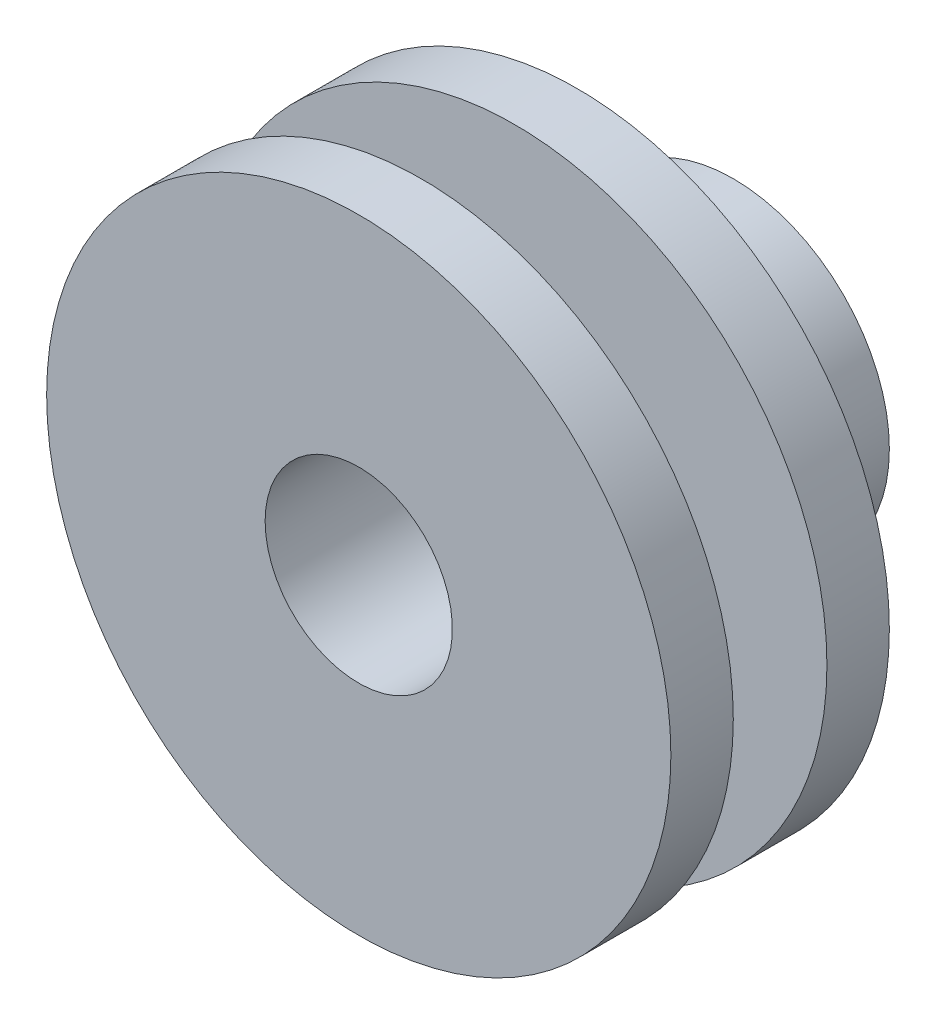
ISO-10303-21;
HEADER;
FILE_DESCRIPTION(('STEP AP214'),'2;1');
FILE_NAME('part.step','',(''),(''),'','','');
FILE_SCHEMA(('AUTOMOTIVE_DESIGN { 1 0 10303 214 1 1 1 1 }'));
ENDSEC;
DATA;
#1=APPLICATION_CONTEXT('core data for automotive mechanical design processes');
#2=APPLICATION_PROTOCOL_DEFINITION('international standard','automotive_design',2000,#1);
#3=PRODUCT_CONTEXT('',#1,'mechanical');
#4=PRODUCT('Part','Part','',(#3));
#5=PRODUCT_RELATED_PRODUCT_CATEGORY('part','',(#4));
#6=PRODUCT_DEFINITION_FORMATION('','',#4);
#7=PRODUCT_DEFINITION_CONTEXT('part definition',#1,'design');
#8=PRODUCT_DEFINITION('design','',#6,#7);
#9=PRODUCT_DEFINITION_SHAPE('','',#8);
#10=(LENGTH_UNIT() NAMED_UNIT(*) SI_UNIT(.MILLI.,.METRE.));
#11=(NAMED_UNIT(*) PLANE_ANGLE_UNIT() SI_UNIT($,.RADIAN.));
#12=(NAMED_UNIT(*) SI_UNIT($,.STERADIAN.) SOLID_ANGLE_UNIT());
#13=UNCERTAINTY_MEASURE_WITH_UNIT(LENGTH_MEASURE(1.E-05),#10,'distance_accuracy_value','');
#14=(GEOMETRIC_REPRESENTATION_CONTEXT(3) GLOBAL_UNCERTAINTY_ASSIGNED_CONTEXT((#13)) GLOBAL_UNIT_ASSIGNED_CONTEXT((#10,
#11,#12)) REPRESENTATION_CONTEXT('',''));
#15=CARTESIAN_POINT('',(0.,0.,0.));
#16=DIRECTION('',(0.,0.,1.));
#17=DIRECTION('',(1.,0.,0.));
#18=AXIS2_PLACEMENT_3D('',#15,#16,#17);
#19=CARTESIAN_POINT('',(0.,0.,0.));
#20=DIRECTION('',(0.,0.,1.));
#21=DIRECTION('',(1.,0.,0.));
#22=AXIS2_PLACEMENT_3D('',#19,#20,#21);
#23=PLANE('',#22);
#24=CARTESIAN_POINT('',(0.,0.,0.));
#25=DIRECTION('',(0.,0.,1.));
#26=DIRECTION('',(1.,0.,0.));
#27=AXIS2_PLACEMENT_3D('',#24,#25,#26);
#28=CIRCLE('',#27,5.);
#29=CARTESIAN_POINT('',(5.,0.,0.));
#30=VERTEX_POINT('',#29);
#31=EDGE_CURVE('E44',#30,#30,#28,.T.);
#32=ORIENTED_EDGE('',*,*,#31,.F.);
#33=EDGE_LOOP('',(#32));
#34=FACE_BOUND('',#33,.T.);
#35=CARTESIAN_POINT('',(0.,0.,0.));
#36=DIRECTION('',(0.,0.,1.));
#37=DIRECTION('',(1.,0.,0.));
#38=AXIS2_PLACEMENT_3D('',#35,#36,#37);
#39=CIRCLE('',#38,3.);
#40=CARTESIAN_POINT('',(3.,0.,0.));
#41=VERTEX_POINT('',#40);
#42=EDGE_CURVE('E53',#41,#41,#39,.T.);
#43=ORIENTED_EDGE('',*,*,#42,.T.);
#44=EDGE_LOOP('',(#43));
#45=FACE_BOUND('',#44,.T.);
#46=ADVANCED_FACE('F39',(#34,#45),#23,.F.);
#47=CARTESIAN_POINT('',(0.,0.,5.));
#48=DIRECTION('',(0.,0.,-1.));
#49=DIRECTION('',(-1.,0.,0.));
#50=AXIS2_PLACEMENT_3D('',#47,#48,#49);
#51=CYLINDRICAL_SURFACE('',#50,5.);
#52=CARTESIAN_POINT('',(1.49167878903844,-4.77230493475981,2.14391534473121));
#53=CARTESIAN_POINT('',(1.49167689702003,-4.77230634928233,2.0748899692689));
#54=CARTESIAN_POINT('',(1.48602414465484,-4.77408365845577,2.00584289539221));
#55=CARTESIAN_POINT('',(1.46359214324519,-4.78100732743095,1.86973155564419));
#56=CARTESIAN_POINT('',(1.44680641865099,-4.7861556479763,1.80266846749705));
#57=CARTESIAN_POINT('',(1.40266716991747,-4.79927602091638,1.67251357563769));
#58=CARTESIAN_POINT('',(1.37532728809784,-4.80724442696224,1.60941676703837));
#59=CARTESIAN_POINT('',(1.31086972752744,-4.82521868449436,1.48875991846125));
#60=CARTESIAN_POINT('',(1.27375163365594,-4.83522462247718,1.4312001136911));
#61=CARTESIAN_POINT('',(1.18988485361615,-4.85655002347249,1.32198452210011));
#62=CARTESIAN_POINT('',(1.14295969064206,-4.8678916100804,1.27046854455619));
#63=CARTESIAN_POINT('',(1.04114859757223,-4.89067749535809,1.17603464755104));
#64=CARTESIAN_POINT('',(0.986261924052269,-4.90212180352601,1.13311753192034));
#65=CARTESIAN_POINT('',(0.86909988669708,-4.92425255712707,1.05652761091557));
#66=CARTESIAN_POINT('',(0.806732111969398,-4.93492619965248,1.02299215065048));
#67=CARTESIAN_POINT('',(0.676930882811401,-4.95439855590894,0.967010522654672));
#68=CARTESIAN_POINT('',(0.609498177480725,-4.96319754616409,0.944562718773456));
#69=CARTESIAN_POINT('',(0.472909352860754,-4.97804965819187,0.911841427441921));
#70=CARTESIAN_POINT('',(0.403815820916356,-4.98415479528959,0.901330522567923));
#71=CARTESIAN_POINT('',(0.264656522202342,-4.99347742520208,0.892036155093437));
#72=CARTESIAN_POINT('',(0.194590900704426,-4.99669534486935,0.893250958626414));
#73=CARTESIAN_POINT('',(0.0571242382784611,-5.00013623795704,0.907202769856286));
#74=CARTESIAN_POINT('',(-0.0103014298681106,-5.00042408336881,0.919683507258142));
#75=CARTESIAN_POINT('',(-0.142196625302667,-4.99841306622039,0.955400979755463));
#76=CARTESIAN_POINT('',(-0.206665995026979,-4.99611406595386,0.978638287419918));
#77=CARTESIAN_POINT('',(-0.331474384505906,-4.98939570164436,1.03541663007475));
#78=CARTESIAN_POINT('',(-0.391770821311243,-4.98495736679415,1.06904886706209));
#79=CARTESIAN_POINT('',(-0.506021467415015,-4.97465954395289,1.14559318428934));
#80=CARTESIAN_POINT('',(-0.559974570785725,-4.96879980869184,1.18850687901152));
#81=CARTESIAN_POINT('',(-0.661512486549662,-4.9563183996494,1.2837697157224));
#82=CARTESIAN_POINT('',(-0.708885422728341,-4.94968039648488,1.3363427909051));
#83=CARTESIAN_POINT('',(-0.794167952806289,-4.93671584037692,1.44871533150134));
#84=CARTESIAN_POINT('',(-0.832077104396616,-4.93038930200152,1.50851513447671));
#85=CARTESIAN_POINT('',(-0.897457778463843,-4.91891063079233,1.63406036180569));
#86=CARTESIAN_POINT('',(-0.924877798591494,-4.9137643412839,1.69983320988781));
#87=CARTESIAN_POINT('',(-0.968096049289099,-4.9054336923531,1.83520807876944));
#88=CARTESIAN_POINT('',(-0.983896766843379,-4.90224891311469,1.90480927672278));
#89=CARTESIAN_POINT('',(-1.00305318962098,-4.8983648378151,2.04389509549277));
#90=CARTESIAN_POINT('',(-1.00672657194741,-4.89760211647129,2.11333424139602));
#91=CARTESIAN_POINT('',(-1.00238965822174,-4.8984915946074,2.25182631302029));
#92=CARTESIAN_POINT('',(-0.994380437694156,-4.90014357178523,2.32087927370683));
#93=CARTESIAN_POINT('',(-0.967193227169785,-4.90558072295166,2.45547247720856));
#94=CARTESIAN_POINT('',(-0.948200119472121,-4.90933055232822,2.52105170801663));
#95=CARTESIAN_POINT('',(-0.899808815165707,-4.91842926272917,2.64813107365705));
#96=CARTESIAN_POINT('',(-0.870409385981234,-4.92377833316385,2.70963072425887));
#97=CARTESIAN_POINT('',(-0.801403886909326,-4.93548333614744,2.82813598366488));
#98=CARTESIAN_POINT('',(-0.761608905212399,-4.94185696200594,2.88502976475275));
#99=CARTESIAN_POINT('',(-0.673217855554666,-4.95467132655259,2.99150952613188));
#100=CARTESIAN_POINT('',(-0.624620341258954,-4.96111207610561,3.04109430305624));
#101=CARTESIAN_POINT('',(-0.518588181440236,-4.97332679760415,3.13282086601668));
#102=CARTESIAN_POINT('',(-0.460962845002641,-4.97908005363381,3.17474537600561));
#103=CARTESIAN_POINT('',(-0.339382225660624,-4.9888408815225,3.24838327820682));
#104=CARTESIAN_POINT('',(-0.275427273156459,-4.99284854444099,3.2800972030353));
#105=CARTESIAN_POINT('',(-0.143475163510295,-4.99837365535276,3.33213836199517));
#106=CARTESIAN_POINT('',(-0.0755111313816414,-4.9999091703039,3.35254748692073));
#107=CARTESIAN_POINT('',(0.0628819375382873,-5.00008285499552,3.38164551203541));
#108=CARTESIAN_POINT('',(0.133310495917419,-4.99872158402299,3.39033667410073));
#109=CARTESIAN_POINT('',(0.272584438206461,-4.99303766191703,3.39562483170062));
#110=CARTESIAN_POINT('',(0.341421139895626,-4.9887960771768,3.39254248110044));
#111=CARTESIAN_POINT('',(0.477423567921002,-4.97762220346026,3.37510556061329));
#112=CARTESIAN_POINT('',(0.544589343891134,-4.97068999450925,3.36075132596482));
#113=CARTESIAN_POINT('',(0.675023740793093,-4.95465856376347,3.32135007001754));
#114=CARTESIAN_POINT('',(0.738311395086077,-4.94557120873107,3.29636102808792));
#115=CARTESIAN_POINT('',(0.859745255100065,-4.92591373250152,3.23645212095704));
#116=CARTESIAN_POINT('',(0.917890811487363,-4.91534342447474,3.20153100389424));
#117=CARTESIAN_POINT('',(1.02892737487265,-4.89332115933659,3.12177130223486));
#118=CARTESIAN_POINT('',(1.08165912540563,-4.88185414719778,3.07671516609698));
#119=CARTESIAN_POINT('',(1.17892293339561,-4.85928381293484,2.97838677976395));
#120=CARTESIAN_POINT('',(1.22345290877097,-4.8481805837462,2.92511244960882));
#121=CARTESIAN_POINT('',(1.30390112598863,-4.82717379434891,2.81066357697954));
#122=CARTESIAN_POINT('',(1.33964320950543,-4.81729647949772,2.74936019046542));
#123=CARTESIAN_POINT('',(1.40036358367896,-4.79999850349553,2.62134598232783));
#124=CARTESIAN_POINT('',(1.42534970564203,-4.79257605589608,2.55463913709778));
#125=CARTESIAN_POINT('',(1.46015783867623,-4.78207078392782,2.43069407994781));
#126=CARTESIAN_POINT('',(1.47195324942532,-4.77843293162581,2.37404888925138));
#127=CARTESIAN_POINT('',(1.48771418335974,-4.77354951642787,2.25957925848125));
#128=CARTESIAN_POINT('',(1.49168037444873,-4.77230374946555,2.20175491942488));
#129=CARTESIAN_POINT('',(1.49167878903844,-4.77230493475981,2.14391534473121));
#130=B_SPLINE_CURVE_WITH_KNOTS('',3,(#52,#53,#54,#55,#56,#57,#58,#59,#60,#61,#62,#63,#64,#65,
#66,#67,#68,#69,#70,#71,#72,#73,#74,#75,#76,#77,#78,#79,#80,#81,#82,#83,#84,#85,#86,#87,#88,#89,
#90,#91,#92,#93,#94,#95,#96,#97,#98,#99,#100,#101,#102,#103,#104,#105,#106,#107,#108,#109,#110,
#111,#112,#113,#114,#115,#116,#117,#118,#119,#120,#121,#122,#123,#124,#125,#126,#127,#128,#129),
.UNSPECIFIED.,.T.,.F.,(4,2,2,2,2,2,2,2,2,2,2,2,2,2,2,2,2,2,2,2,2,2,2,2,2,2,2,2,2,2,2,2,2,2,2,2,
2,2,4),(0.,0.206863720868067,0.413847870714331,0.620565363583007,0.827291633777388,
1.03811977096488,1.24896760739933,1.46275748198959,1.67651579923545,1.88594375497672,
2.09534074333009,2.30009131344472,2.50485278362392,2.71146437127221,2.91811192734455,
3.13035233285954,3.34260265599899,3.55588216004199,3.76911600064772,3.97671787380856,
4.18430063591899,4.38848702504601,4.59269760710706,4.80091422929576,5.00916509442519,
5.22262665482657,5.43607707859774,5.64796036403461,5.85980274454516,6.06591723063725,
6.27202558688487,6.47702438279852,6.68204902869032,6.89198548291032,7.10197515782751,
7.31588238642335,7.52963360683306,7.70298913588661,7.87632987549756),.UNSPECIFIED.);
#131=CARTESIAN_POINT('',(1.49167878903844,-4.77230493475981,2.14391534473121));
#132=VERTEX_POINT('',#131);
#133=EDGE_CURVE('E86',#132,#132,#130,.T.);
#134=ORIENTED_EDGE('',*,*,#133,.T.);
#135=EDGE_LOOP('',(#134));
#136=FACE_BOUND('',#135,.T.);
#137=CARTESIAN_POINT('',(0.,0.,5.));
#138=DIRECTION('',(0.,0.,1.));
#139=DIRECTION('',(1.,0.,0.));
#140=AXIS2_PLACEMENT_3D('',#137,#138,#139);
#141=CIRCLE('',#140,5.);
#142=CARTESIAN_POINT('',(5.,0.,5.));
#143=VERTEX_POINT('',#142);
#144=EDGE_CURVE('E10',#143,#143,#141,.T.);
#145=ORIENTED_EDGE('',*,*,#144,.F.);
#146=EDGE_LOOP('',(#145));
#147=FACE_BOUND('',#146,.T.);
#148=ORIENTED_EDGE('',*,*,#31,.T.);
#149=EDGE_LOOP('',(#148));
#150=FACE_BOUND('',#149,.T.);
#151=ADVANCED_FACE('F41',(#136,#147,#150),#51,.T.);
#152=CARTESIAN_POINT('',(0.,0.,5.));
#153=DIRECTION('',(0.,0.,-1.));
#154=DIRECTION('',(-1.,0.,0.));
#155=AXIS2_PLACEMENT_3D('',#152,#153,#154);
#156=CYLINDRICAL_SURFACE('',#155,3.);
#157=CARTESIAN_POINT('',(1.38545383099857,-2.66092421578883,2.14391534473121));
#158=CARTESIAN_POINT('',(1.38544679114328,-2.66093174600651,2.07724345383435));
#159=CARTESIAN_POINT('',(1.38021729183885,-2.66367137359121,2.01046268790499));
#160=CARTESIAN_POINT('',(1.3594902208194,-2.67430602366312,1.87882840267407));
#161=CARTESIAN_POINT('',(1.34396476533493,-2.68221504519329,1.81398061805597));
#162=CARTESIAN_POINT('',(1.30332367199318,-2.70219429759885,1.68835421504013));
#163=CARTESIAN_POINT('',(1.27824712675196,-2.71424754683967,1.62756018101619));
#164=CARTESIAN_POINT('',(1.21928587266197,-2.7412385840525,1.51115589515316));
#165=CARTESIAN_POINT('',(1.18540324740859,-2.75617568946427,1.45554442129809));
#166=CARTESIAN_POINT('',(1.10748348781613,-2.78843208523749,1.34758961975774));
#167=CARTESIAN_POINT('',(1.06298123757245,-2.80583823640156,1.29560778598712));
#168=CARTESIAN_POINT('',(0.965978526329279,-2.84069364388933,1.19971512223366));
#169=CARTESIAN_POINT('',(0.913474995731533,-2.85814291421687,1.1558074041182));
#170=CARTESIAN_POINT('',(0.799100323430222,-2.89225634984006,1.07546581385193));
#171=CARTESIAN_POINT('',(0.73692164578405,-2.90885363447924,1.03943871669886));
#172=CARTESIAN_POINT('',(0.606564394243463,-2.93879933656774,0.978639324225608));
#173=CARTESIAN_POINT('',(0.538388499856499,-2.95214919500254,0.953862032766995));
#174=CARTESIAN_POINT('',(0.401698126834175,-2.97374743052062,0.917575885974473));
#175=CARTESIAN_POINT('',(0.333385894110534,-2.98222513244724,0.905443649829167));
#176=CARTESIAN_POINT('',(0.195287724652109,-2.99443816831912,0.892777703571356));
#177=CARTESIAN_POINT('',(0.125502397185949,-2.99817542529125,0.892239288848252));
#178=CARTESIAN_POINT('',(-0.00902791885301256,-3.00069534784421,0.902449625664532));
#179=CARTESIAN_POINT('',(-0.0738211851174021,-2.99976570297799,0.91251344525694));
#180=CARTESIAN_POINT('',(-0.200899753447096,-2.99394169783605,0.942468447369375));
#181=CARTESIAN_POINT('',(-0.263184870259452,-2.98904704526498,0.962360354361377));
#182=CARTESIAN_POINT('',(-0.384594446786624,-2.97588236943789,1.01164338562585));
#183=CARTESIAN_POINT('',(-0.443656186723513,-2.96756198805153,1.04117480760204));
#184=CARTESIAN_POINT('',(-0.556259212355057,-2.94853209490002,1.10876110143155));
#185=CARTESIAN_POINT('',(-0.609798537263984,-2.93782173879235,1.1468189855762));
#186=CARTESIAN_POINT('',(-0.71380416466175,-2.91436496174055,1.23349776513583));
#187=CARTESIAN_POINT('',(-0.763787837116665,-2.90152823740883,1.28267413601022));
#188=CARTESIAN_POINT('',(-0.855002118278728,-2.87597287343849,1.38862678543779));
#189=CARTESIAN_POINT('',(-0.896229349232412,-2.86325428117125,1.4454059830233));
#190=CARTESIAN_POINT('',(-0.969968535097738,-2.83914059427698,1.56731038139312));
#191=CARTESIAN_POINT('',(-1.00214952124901,-2.82780273599979,1.63264855047449));
#192=CARTESIAN_POINT('',(-1.05467050317575,-2.80864041459464,1.76839638970571));
#193=CARTESIAN_POINT('',(-1.07501896554427,-2.80081344022296,1.83880239300075));
#194=CARTESIAN_POINT('',(-1.10198733109501,-2.79030847476632,1.97781215364521));
#195=CARTESIAN_POINT('',(-1.10941229667032,-2.78732936142461,2.04623646699026));
#196=CARTESIAN_POINT('',(-1.11267182795017,-2.7860306791078,2.18339382714271));
#197=CARTESIAN_POINT('',(-1.10851040349725,-2.78770949810486,2.25212675892292));
#198=CARTESIAN_POINT('',(-1.08946002536754,-2.79520438657093,2.38331373016165));
#199=CARTESIAN_POINT('',(-1.0752749339499,-2.80074869693281,2.44588803151801));
#200=CARTESIAN_POINT('',(-1.03753832000012,-2.81494539704105,2.56776664122908));
#201=CARTESIAN_POINT('',(-1.01398460815321,-2.82359851322584,2.62707018156191));
#202=CARTESIAN_POINT('',(-0.957111998901429,-2.84339181559625,2.74353065508767));
#203=CARTESIAN_POINT('',(-0.92342179228409,-2.85462180912228,2.80049031934153));
#204=CARTESIAN_POINT('',(-0.847658951466137,-2.87802792704141,2.90832339723022));
#205=CARTESIAN_POINT('',(-0.805582689353646,-2.89020445952353,2.95919416143307));
#206=CARTESIAN_POINT('',(-0.710263425331896,-2.91515726072067,3.05771547961521));
#207=CARTESIAN_POINT('',(-0.656390210351152,-2.92790165518948,3.10476674468186));
#208=CARTESIAN_POINT('',(-0.541238021485154,-2.95135736426589,3.18938763671053));
#209=CARTESIAN_POINT('',(-0.479958505342897,-2.96206852986159,3.2269565687949));
#210=CARTESIAN_POINT('',(-0.35135902996874,-2.98006165676206,3.29150522017478));
#211=CARTESIAN_POINT('',(-0.284024009413148,-2.98733476947777,3.31845758602068));
#212=CARTESIAN_POINT('',(-0.145438113173097,-2.9972756857411,3.36053213706563));
#213=CARTESIAN_POINT('',(-0.0741895950802496,-2.99994623126639,3.37566136295727));
#214=CARTESIAN_POINT('',(0.0648090947821733,-3.0000484909428,3.39277347025151));
#215=CARTESIAN_POINT('',(0.132455688866621,-2.99783334440976,3.39560134442816));
#216=CARTESIAN_POINT('',(0.267005383324585,-2.98885445877756,3.39030220343726));
#217=CARTESIAN_POINT('',(0.333908611963188,-2.98209151717432,3.38217710871833));
#218=CARTESIAN_POINT('',(0.462643476192199,-2.96479924912555,3.35580927257254));
#219=CARTESIAN_POINT('',(0.524570829988508,-2.95441203997156,3.33793566426165));
#220=CARTESIAN_POINT('',(0.644361339532228,-2.93061961539624,3.29298109752207));
#221=CARTESIAN_POINT('',(0.702223720723897,-2.91721382683834,3.2658983900663));
#222=CARTESIAN_POINT('',(0.815155184405698,-2.88774681780898,3.20192581551674));
#223=CARTESIAN_POINT('',(0.869979846365487,-2.87159296968466,3.16464804330721));
#224=CARTESIAN_POINT('',(0.972769971033962,-2.83842218918463,3.08190816185931));
#225=CARTESIAN_POINT('',(1.02073287547964,-2.82140493809369,3.03644301432445));
#226=CARTESIAN_POINT('',(1.11188293158216,-2.78679979041306,2.9349705188768));
#227=CARTESIAN_POINT('',(1.15452302744049,-2.76925185860817,2.87845633011008));
#228=CARTESIAN_POINT('',(1.22989383414854,-2.73661376390522,2.75845660405101));
#229=CARTESIAN_POINT('',(1.26261900564365,-2.72152497707031,2.69496719667306));
#230=CARTESIAN_POINT('',(1.31694023096859,-2.69565825023024,2.56297150970845));
#231=CARTESIAN_POINT('',(1.3385954530032,-2.68485746192737,2.49449418593799));
#232=CARTESIAN_POINT('',(1.37007259561222,-2.66893720227683,2.35437577088054));
#233=CARTESIAN_POINT('',(1.37993420739114,-2.6637986792825,2.2827461374569));
#234=CARTESIAN_POINT('',(1.38487288786228,-2.6612255558175,2.18855682046932));
#235=CARTESIAN_POINT('',(1.38545618847995,-2.66092169409666,2.16624218734317));
#236=CARTESIAN_POINT('',(1.38545383099857,-2.66092421578883,2.14391534473121));
#237=B_SPLINE_CURVE_WITH_KNOTS('',3,(#157,#158,#159,#160,#161,#162,#163,#164,#165,#166,#167,
#168,#169,#170,#171,#172,#173,#174,#175,#176,#177,#178,#179,#180,#181,#182,#183,#184,#185,#186,
#187,#188,#189,#190,#191,#192,#193,#194,#195,#196,#197,#198,#199,#200,#201,#202,#203,#204,#205,
#206,#207,#208,#209,#210,#211,#212,#213,#214,#215,#216,#217,#218,#219,#220,#221,#222,#223,#224,
#225,#226,#227,#228,#229,#230,#231,#232,#233,#234,#235,#236),.UNSPECIFIED.,.T.,.F.,(4,2,2,2,2,2,
2,2,2,2,2,2,2,2,2,2,2,2,2,2,2,2,2,2,2,2,2,2,2,2,2,2,2,2,2,2,2,2,2,4),(0.,0.199951711985514,
0.400447161842174,0.600130652152109,0.799766938550097,1.01066841430653,1.2216510045991,
1.44178476577923,1.6618206677489,1.87040605977951,2.07890680917929,2.27471840245092,
2.47054443201882,2.66935814640064,2.86824221022483,3.08114531844483,3.29413040441365,
3.5141154566672,3.73394290745567,3.93950778306306,4.14500152518447,4.3373390106619,
4.52972146913527,4.73025126818167,4.93086800795463,5.14781662735511,5.36478114041864,
5.58230105955592,5.79969134643005,6.0018863509405,6.20404590801911,6.39903415036485,
6.59405944632169,6.79789862829034,7.00181361048901,7.21960426908074,7.43751638139185,
7.65425125796861,7.87025464546159,7.93721375436702),.UNSPECIFIED.);
#238=CARTESIAN_POINT('',(1.38545383099857,-2.66092421578883,2.14391534473121));
#239=VERTEX_POINT('',#238);
#240=EDGE_CURVE('E94',#239,#239,#237,.T.);
#241=ORIENTED_EDGE('',*,*,#240,.F.);
#242=EDGE_LOOP('',(#241));
#243=FACE_BOUND('',#242,.T.);
#244=ORIENTED_EDGE('',*,*,#42,.F.);
#245=EDGE_LOOP('',(#244));
#246=FACE_BOUND('',#245,.T.);
#247=CARTESIAN_POINT('',(0.,0.,12.));
#248=DIRECTION('',(0.,0.,-1.));
#249=DIRECTION('',(-1.,0.,0.));
#250=AXIS2_PLACEMENT_3D('',#247,#248,#249);
#251=CIRCLE('',#250,3.);
#252=CARTESIAN_POINT('',(-3.,0.,12.));
#253=VERTEX_POINT('',#252);
#254=EDGE_CURVE('E79',#253,#253,#251,.T.);
#255=ORIENTED_EDGE('',*,*,#254,.F.);
#256=EDGE_LOOP('',(#255));
#257=FACE_BOUND('',#256,.T.);
#258=ADVANCED_FACE('F127',(#243,#246,#257),#156,.F.);
#259=CARTESIAN_POINT('',(0.,0.,7.));
#260=DIRECTION('',(0.,0.,1.));
#261=DIRECTION('',(1.,0.,0.));
#262=AXIS2_PLACEMENT_3D('',#259,#260,#261);
#263=PLANE('',#262);
#264=CARTESIAN_POINT('',(0.,0.,7.));
#265=DIRECTION('',(0.,0.,1.));
#266=DIRECTION('',(1.,0.,0.));
#267=AXIS2_PLACEMENT_3D('',#264,#265,#266);
#268=CIRCLE('',#267,5.);
#269=CARTESIAN_POINT('',(5.,0.,7.));
#270=VERTEX_POINT('',#269);
#271=EDGE_CURVE('E67',#270,#270,#268,.T.);
#272=ORIENTED_EDGE('',*,*,#271,.F.);
#273=EDGE_LOOP('',(#272));
#274=FACE_BOUND('',#273,.T.);
#275=CARTESIAN_POINT('',(0.,0.,7.));
#276=DIRECTION('',(0.,0.,1.));
#277=DIRECTION('',(1.,0.,0.));
#278=AXIS2_PLACEMENT_3D('',#275,#276,#277);
#279=CIRCLE('',#278,10.);
#280=CARTESIAN_POINT('',(10.,0.,7.));
#281=VERTEX_POINT('',#280);
#282=EDGE_CURVE('E58',#281,#281,#279,.T.);
#283=ORIENTED_EDGE('',*,*,#282,.T.);
#284=EDGE_LOOP('',(#283));
#285=FACE_BOUND('',#284,.T.);
#286=ADVANCED_FACE('F123',(#274,#285),#263,.T.);
#287=CARTESIAN_POINT('',(0.,0.,5.));
#288=DIRECTION('',(0.,0.,1.));
#289=DIRECTION('',(1.,0.,0.));
#290=AXIS2_PLACEMENT_3D('',#287,#288,#289);
#291=PLANE('',#290);
#292=ORIENTED_EDGE('',*,*,#144,.T.);
#293=EDGE_LOOP('',(#292));
#294=FACE_BOUND('',#293,.T.);
#295=CARTESIAN_POINT('',(0.,0.,5.));
#296=DIRECTION('',(0.,0.,1.));
#297=DIRECTION('',(1.,0.,0.));
#298=AXIS2_PLACEMENT_3D('',#295,#296,#297);
#299=CIRCLE('',#298,10.);
#300=CARTESIAN_POINT('',(10.,0.,5.));
#301=VERTEX_POINT('',#300);
#302=EDGE_CURVE('E59',#301,#301,#299,.T.);
#303=ORIENTED_EDGE('',*,*,#302,.F.);
#304=EDGE_LOOP('',(#303));
#305=FACE_BOUND('',#304,.T.);
#306=ADVANCED_FACE('F126',(#294,#305),#291,.F.);
#307=CARTESIAN_POINT('',(0.,0.,7.));
#308=DIRECTION('',(0.,0.,-1.));
#309=DIRECTION('',(-1.,0.,0.));
#310=AXIS2_PLACEMENT_3D('',#307,#308,#309);
#311=CYLINDRICAL_SURFACE('',#310,10.);
#312=ORIENTED_EDGE('',*,*,#282,.F.);
#313=EDGE_LOOP('',(#312));
#314=FACE_BOUND('',#313,.T.);
#315=ORIENTED_EDGE('',*,*,#302,.T.);
#316=EDGE_LOOP('',(#315));
#317=FACE_BOUND('',#316,.T.);
#318=ADVANCED_FACE('F121',(#314,#317),#311,.T.);
#319=CARTESIAN_POINT('',(0.,0.,10.));
#320=DIRECTION('',(0.,0.,-1.));
#321=DIRECTION('',(-1.,0.,0.));
#322=AXIS2_PLACEMENT_3D('',#319,#320,#321);
#323=CYLINDRICAL_SURFACE('',#322,5.);
#324=CARTESIAN_POINT('',(0.,0.,10.));
#325=DIRECTION('',(0.,0.,1.));
#326=DIRECTION('',(1.,0.,0.));
#327=AXIS2_PLACEMENT_3D('',#324,#325,#326);
#328=CIRCLE('',#327,5.);
#329=CARTESIAN_POINT('',(5.,0.,10.));
#330=VERTEX_POINT('',#329);
#331=EDGE_CURVE('E63',#330,#330,#328,.T.);
#332=ORIENTED_EDGE('',*,*,#331,.F.);
#333=EDGE_LOOP('',(#332));
#334=FACE_BOUND('',#333,.T.);
#335=ORIENTED_EDGE('',*,*,#271,.T.);
#336=EDGE_LOOP('',(#335));
#337=FACE_BOUND('',#336,.T.);
#338=ADVANCED_FACE('F117',(#334,#337),#323,.T.);
#339=CARTESIAN_POINT('',(0.,0.,12.));
#340=DIRECTION('',(0.,0.,-1.));
#341=DIRECTION('',(-1.,0.,0.));
#342=AXIS2_PLACEMENT_3D('',#339,#340,#341);
#343=CYLINDRICAL_SURFACE('',#342,10.);
#344=CARTESIAN_POINT('',(0.,0.,12.));
#345=DIRECTION('',(0.,0.,1.));
#346=DIRECTION('',(1.,0.,0.));
#347=AXIS2_PLACEMENT_3D('',#344,#345,#346);
#348=CIRCLE('',#347,10.);
#349=CARTESIAN_POINT('',(10.,0.,12.));
#350=VERTEX_POINT('',#349);
#351=EDGE_CURVE('E71',#350,#350,#348,.T.);
#352=ORIENTED_EDGE('',*,*,#351,.F.);
#353=EDGE_LOOP('',(#352));
#354=FACE_BOUND('',#353,.T.);
#355=CARTESIAN_POINT('',(0.,0.,10.));
#356=DIRECTION('',(0.,0.,1.));
#357=DIRECTION('',(1.,0.,0.));
#358=AXIS2_PLACEMENT_3D('',#355,#356,#357);
#359=CIRCLE('',#358,10.);
#360=CARTESIAN_POINT('',(10.,0.,10.));
#361=VERTEX_POINT('',#360);
#362=EDGE_CURVE('E75',#361,#361,#359,.T.);
#363=ORIENTED_EDGE('',*,*,#362,.T.);
#364=EDGE_LOOP('',(#363));
#365=FACE_BOUND('',#364,.T.);
#366=ADVANCED_FACE('F110',(#354,#365),#343,.T.);
#367=CARTESIAN_POINT('',(0.,0.,12.));
#368=DIRECTION('',(0.,0.,1.));
#369=DIRECTION('',(1.,0.,0.));
#370=AXIS2_PLACEMENT_3D('',#367,#368,#369);
#371=PLANE('',#370);
#372=ORIENTED_EDGE('',*,*,#254,.T.);
#373=EDGE_LOOP('',(#372));
#374=FACE_BOUND('',#373,.T.);
#375=ORIENTED_EDGE('',*,*,#351,.T.);
#376=EDGE_LOOP('',(#375));
#377=FACE_BOUND('',#376,.T.);
#378=ADVANCED_FACE('F107',(#374,#377),#371,.T.);
#379=CARTESIAN_POINT('',(0.,0.,10.));
#380=DIRECTION('',(0.,0.,1.));
#381=DIRECTION('',(1.,0.,0.));
#382=AXIS2_PLACEMENT_3D('',#379,#380,#381);
#383=PLANE('',#382);
#384=ORIENTED_EDGE('',*,*,#331,.T.);
#385=EDGE_LOOP('',(#384));
#386=FACE_BOUND('',#385,.T.);
#387=ORIENTED_EDGE('',*,*,#362,.F.);
#388=EDGE_LOOP('',(#387));
#389=FACE_BOUND('',#388,.T.);
#390=ADVANCED_FACE('F102',(#386,#389),#383,.F.);
#391=CARTESIAN_POINT('',(0.251235543269238,-4.99368408109666,2.14391534473121));
#392=DIRECTION('',(0.0502471086538475,-0.998736816219332,0.));
#393=DIRECTION('',(0.998736816219333,0.0502471086538475,0.));
#394=AXIS2_PLACEMENT_3D('',#391,#392,#393);
#395=CYLINDRICAL_SURFACE('',#394,1.24999999999999);
#396=ORIENTED_EDGE('',*,*,#240,.T.);
#397=EDGE_LOOP('',(#396));
#398=FACE_BOUND('',#397,.T.);
#399=ORIENTED_EDGE('',*,*,#133,.F.);
#400=EDGE_LOOP('',(#399));
#401=FACE_BOUND('',#400,.T.);
#402=ADVANCED_FACE('F99',(#398,#401),#395,.F.);
#403=CLOSED_SHELL('',(#46,#151,#258,#286,#306,#318,#338,#366,#378,#390,#402));
#404=MANIFOLD_SOLID_BREP('B2',#403);
#405=ADVANCED_BREP_SHAPE_REPRESENTATION('',(#18,#404),#14);
#406=SHAPE_DEFINITION_REPRESENTATION(#9,#405);
ENDSEC;
END-ISO-10303-21;
